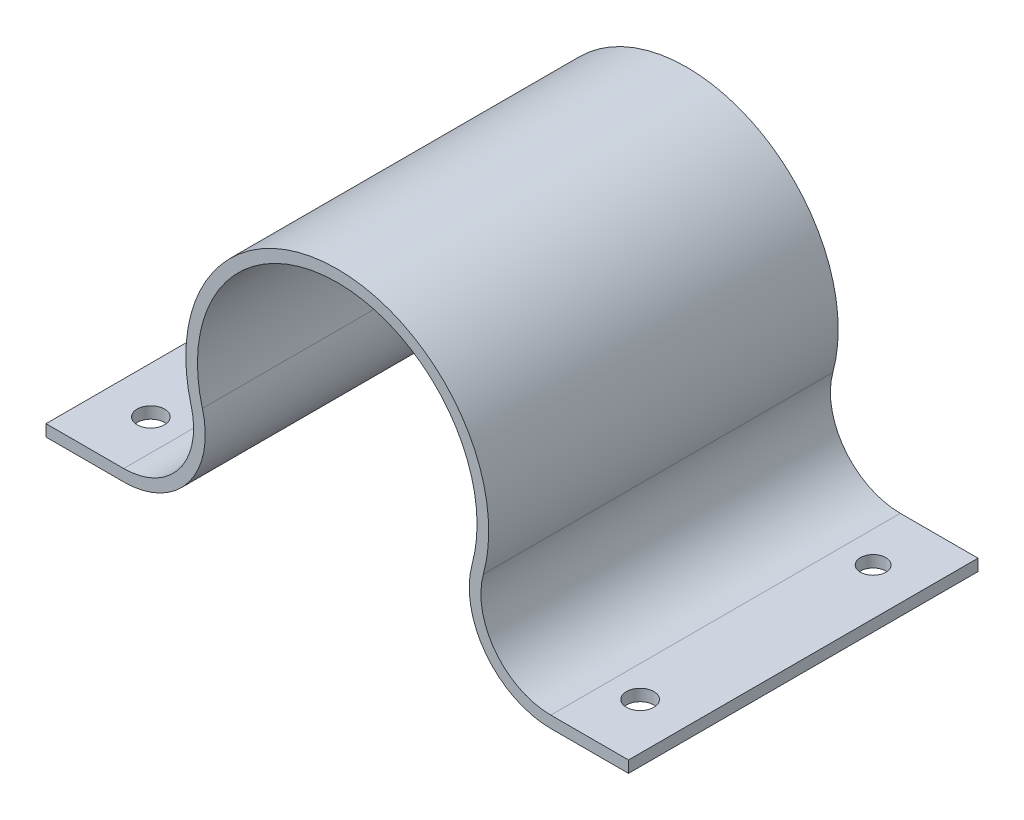
ISO-10303-21;
HEADER;
FILE_DESCRIPTION(('STEP AP214'),'2;1');
FILE_NAME('part.step','',(''),(''),'','','');
FILE_SCHEMA(('AUTOMOTIVE_DESIGN { 1 0 10303 214 1 1 1 1 }'));
ENDSEC;
DATA;
#1=APPLICATION_CONTEXT('core data for automotive mechanical design processes');
#2=APPLICATION_PROTOCOL_DEFINITION('international standard','automotive_design',2000,#1);
#3=PRODUCT_CONTEXT('',#1,'mechanical');
#4=PRODUCT('Part','Part','',(#3));
#5=PRODUCT_RELATED_PRODUCT_CATEGORY('part','',(#4));
#6=PRODUCT_DEFINITION_FORMATION('','',#4);
#7=PRODUCT_DEFINITION_CONTEXT('part definition',#1,'design');
#8=PRODUCT_DEFINITION('design','',#6,#7);
#9=PRODUCT_DEFINITION_SHAPE('','',#8);
#10=(LENGTH_UNIT() NAMED_UNIT(*) SI_UNIT(.MILLI.,.METRE.));
#11=(NAMED_UNIT(*) PLANE_ANGLE_UNIT() SI_UNIT($,.RADIAN.));
#12=(NAMED_UNIT(*) SI_UNIT($,.STERADIAN.) SOLID_ANGLE_UNIT());
#13=UNCERTAINTY_MEASURE_WITH_UNIT(LENGTH_MEASURE(1.E-05),#10,'distance_accuracy_value','');
#14=(GEOMETRIC_REPRESENTATION_CONTEXT(3) GLOBAL_UNCERTAINTY_ASSIGNED_CONTEXT((#13)) GLOBAL_UNIT_ASSIGNED_CONTEXT((#10,
#11,#12)) REPRESENTATION_CONTEXT('',''));
#15=CARTESIAN_POINT('',(0.,0.,0.));
#16=DIRECTION('',(0.,0.,1.));
#17=DIRECTION('',(1.,0.,0.));
#18=AXIS2_PLACEMENT_3D('',#15,#16,#17);
#19=CARTESIAN_POINT('',(-25.,-12.,30.));
#20=DIRECTION('',(0.,1.,0.));
#21=DIRECTION('',(0.,0.,1.));
#22=AXIS2_PLACEMENT_3D('',#19,#20,#21);
#23=PLANE('',#22);
#24=CARTESIAN_POINT('',(-21.,-12.,5.));
#25=DIRECTION('',(0.,1.,0.));
#26=DIRECTION('',(0.,0.,1.));
#27=AXIS2_PLACEMENT_3D('',#24,#25,#26);
#28=CIRCLE('',#27,1.08948365884662);
#29=CARTESIAN_POINT('',(-21.,-12.,6.08948365884662));
#30=VERTEX_POINT('',#29);
#31=EDGE_CURVE('E261',#30,#30,#28,.F.);
#32=ORIENTED_EDGE('',*,*,#31,.F.);
#33=EDGE_LOOP('',(#32));
#34=FACE_BOUND('',#33,.T.);
#35=DIRECTION('',(1.,0.,0.));
#36=VECTOR('',#35,1.);
#37=CARTESIAN_POINT('',(-25.,-12.,0.));
#38=LINE('',#37,#36);
#39=CARTESIAN_POINT('',(-25.,-12.,0.));
#40=VERTEX_POINT('',#39);
#41=CARTESIAN_POINT('',(-18.3303027798234,-12.,0.));
#42=VERTEX_POINT('',#41);
#43=EDGE_CURVE('E157',#40,#42,#38,.T.);
#44=ORIENTED_EDGE('',*,*,#43,.T.);
#45=DIRECTION('',(0.,0.,-1.));
#46=VECTOR('',#45,1.);
#47=CARTESIAN_POINT('',(-18.3303027798234,-12.,30.));
#48=LINE('',#47,#46);
#49=CARTESIAN_POINT('',(-18.3303027798234,-12.,30.));
#50=VERTEX_POINT('',#49);
#51=EDGE_CURVE('E42',#50,#42,#48,.T.);
#52=ORIENTED_EDGE('',*,*,#51,.F.);
#53=DIRECTION('',(1.,0.,0.));
#54=VECTOR('',#53,1.);
#55=CARTESIAN_POINT('',(-25.,-12.,30.));
#56=LINE('',#55,#54);
#57=CARTESIAN_POINT('',(-25.,-12.,30.));
#58=VERTEX_POINT('',#57);
#59=EDGE_CURVE('E105',#58,#50,#56,.T.);
#60=ORIENTED_EDGE('',*,*,#59,.F.);
#61=DIRECTION('',(0.,0.,-1.));
#62=VECTOR('',#61,1.);
#63=CARTESIAN_POINT('',(-25.,-12.,30.));
#64=LINE('',#63,#62);
#65=EDGE_CURVE('E11',#58,#40,#64,.T.);
#66=ORIENTED_EDGE('',*,*,#65,.T.);
#67=EDGE_LOOP('',(#44,#52,#60,#66));
#68=FACE_BOUND('',#67,.T.);
#69=CARTESIAN_POINT('',(-21.,-12.,25.));
#70=DIRECTION('',(0.,1.,0.));
#71=DIRECTION('',(0.,0.,1.));
#72=AXIS2_PLACEMENT_3D('',#69,#70,#71);
#73=CIRCLE('',#72,1.17399486576721);
#74=CARTESIAN_POINT('',(-21.,-12.,26.1739948657672));
#75=VERTEX_POINT('',#74);
#76=EDGE_CURVE('E253',#75,#75,#73,.F.);
#77=ORIENTED_EDGE('',*,*,#76,.F.);
#78=EDGE_LOOP('',(#77));
#79=FACE_BOUND('',#78,.T.);
#80=ADVANCED_FACE('F33',(#34,#68,#79),#23,.F.);
#81=CARTESIAN_POINT('',(-25.,-11.,30.));
#82=DIRECTION('',(0.,-1.,0.));
#83=DIRECTION('',(0.,0.,-1.));
#84=AXIS2_PLACEMENT_3D('',#81,#82,#83);
#85=PLANE('',#84);
#86=CARTESIAN_POINT('',(-21.,-11.,5.));
#87=DIRECTION('',(0.,-1.,0.));
#88=DIRECTION('',(1.,0.,0.));
#89=AXIS2_PLACEMENT_3D('',#86,#87,#88);
#90=CIRCLE('',#89,1.08948365884662);
#91=CARTESIAN_POINT('',(-19.9105163411534,-11.,5.));
#92=VERTEX_POINT('',#91);
#93=EDGE_CURVE('E256',#92,#92,#90,.T.);
#94=ORIENTED_EDGE('',*,*,#93,.T.);
#95=EDGE_LOOP('',(#94));
#96=FACE_BOUND('',#95,.T.);
#97=DIRECTION('',(-1.,0.,0.));
#98=VECTOR('',#97,1.);
#99=CARTESIAN_POINT('',(-25.,-11.,0.));
#100=LINE('',#99,#98);
#101=CARTESIAN_POINT('',(-18.3303027798234,-11.,0.));
#102=VERTEX_POINT('',#101);
#103=CARTESIAN_POINT('',(-25.,-11.,0.));
#104=VERTEX_POINT('',#103);
#105=EDGE_CURVE('E97',#102,#104,#100,.T.);
#106=ORIENTED_EDGE('',*,*,#105,.T.);
#107=DIRECTION('',(0.,0.,-1.));
#108=VECTOR('',#107,1.);
#109=CARTESIAN_POINT('',(-25.,-11.,30.));
#110=LINE('',#109,#108);
#111=CARTESIAN_POINT('',(-25.,-11.,30.));
#112=VERTEX_POINT('',#111);
#113=EDGE_CURVE('E150',#112,#104,#110,.T.);
#114=ORIENTED_EDGE('',*,*,#113,.F.);
#115=DIRECTION('',(-1.,0.,0.));
#116=VECTOR('',#115,1.);
#117=CARTESIAN_POINT('',(-25.,-11.,30.));
#118=LINE('',#117,#116);
#119=CARTESIAN_POINT('',(-18.3303027798234,-11.,30.));
#120=VERTEX_POINT('',#119);
#121=EDGE_CURVE('E50',#120,#112,#118,.T.);
#122=ORIENTED_EDGE('',*,*,#121,.F.);
#123=DIRECTION('',(0.,0.,-1.));
#124=VECTOR('',#123,1.);
#125=CARTESIAN_POINT('',(-18.3303027798234,-11.,30.));
#126=LINE('',#125,#124);
#127=EDGE_CURVE('E146',#120,#102,#126,.T.);
#128=ORIENTED_EDGE('',*,*,#127,.T.);
#129=EDGE_LOOP('',(#106,#114,#122,#128));
#130=FACE_BOUND('',#129,.T.);
#131=CARTESIAN_POINT('',(-21.,-11.,25.));
#132=DIRECTION('',(0.,-1.,0.));
#133=DIRECTION('',(1.,0.,0.));
#134=AXIS2_PLACEMENT_3D('',#131,#132,#133);
#135=CIRCLE('',#134,1.17399486576721);
#136=CARTESIAN_POINT('',(-19.8260051342328,-11.,25.));
#137=VERTEX_POINT('',#136);
#138=EDGE_CURVE('E251',#137,#137,#135,.T.);
#139=ORIENTED_EDGE('',*,*,#138,.T.);
#140=EDGE_LOOP('',(#139));
#141=FACE_BOUND('',#140,.T.);
#142=ADVANCED_FACE('F244',(#96,#130,#141),#85,.F.);
#143=CARTESIAN_POINT('',(-25.,-12.,30.));
#144=DIRECTION('',(1.,0.,0.));
#145=DIRECTION('',(0.,0.,-1.));
#146=AXIS2_PLACEMENT_3D('',#143,#144,#145);
#147=PLANE('',#146);
#148=DIRECTION('',(0.,-1.,0.));
#149=VECTOR('',#148,1.);
#150=CARTESIAN_POINT('',(-25.,-12.,0.));
#151=LINE('',#150,#149);
#152=EDGE_CURVE('E154',#104,#40,#151,.T.);
#153=ORIENTED_EDGE('',*,*,#152,.T.);
#154=ORIENTED_EDGE('',*,*,#65,.F.);
#155=DIRECTION('',(0.,-1.,0.));
#156=VECTOR('',#155,1.);
#157=CARTESIAN_POINT('',(-25.,-12.,30.));
#158=LINE('',#157,#156);
#159=EDGE_CURVE('E177',#112,#58,#158,.T.);
#160=ORIENTED_EDGE('',*,*,#159,.F.);
#161=ORIENTED_EDGE('',*,*,#113,.T.);
#162=EDGE_LOOP('',(#153,#154,#160,#161));
#163=FACE_BOUND('',#162,.T.);
#164=ADVANCED_FACE('F35',(#163),#147,.F.);
#165=CARTESIAN_POINT('',(-18.3303027798234,-5.,30.));
#166=DIRECTION('',(0.,0.,-1.));
#167=DIRECTION('',(-1.,0.,0.));
#168=AXIS2_PLACEMENT_3D('',#165,#166,#167);
#169=CYLINDRICAL_SURFACE('',#168,7.);
#170=CARTESIAN_POINT('',(-18.3303027798234,-5.,0.));
#171=DIRECTION('',(0.,0.,1.));
#172=DIRECTION('',(1.,0.,0.));
#173=AXIS2_PLACEMENT_3D('',#170,#171,#172);
#174=CIRCLE('',#173,7.);
#175=CARTESIAN_POINT('',(-11.5770333346253,-3.1578947368421,0.));
#176=VERTEX_POINT('',#175);
#177=EDGE_CURVE('E160',#42,#176,#174,.T.);
#178=ORIENTED_EDGE('',*,*,#177,.T.);
#179=DIRECTION('',(0.,0.,-1.));
#180=VECTOR('',#179,1.);
#181=CARTESIAN_POINT('',(-11.5770333346253,-3.1578947368421,30.));
#182=LINE('',#181,#180);
#183=CARTESIAN_POINT('',(-11.5770333346253,-3.1578947368421,30.));
#184=VERTEX_POINT('',#183);
#185=EDGE_CURVE('E196',#184,#176,#182,.T.);
#186=ORIENTED_EDGE('',*,*,#185,.F.);
#187=CARTESIAN_POINT('',(-18.3303027798234,-5.,30.));
#188=DIRECTION('',(0.,0.,1.));
#189=DIRECTION('',(1.,0.,0.));
#190=AXIS2_PLACEMENT_3D('',#187,#188,#189);
#191=CIRCLE('',#190,7.);
#192=EDGE_CURVE('E204',#50,#184,#191,.T.);
#193=ORIENTED_EDGE('',*,*,#192,.F.);
#194=ORIENTED_EDGE('',*,*,#51,.T.);
#195=EDGE_LOOP('',(#178,#186,#193,#194));
#196=FACE_BOUND('',#195,.T.);
#197=ADVANCED_FACE('F202',(#196),#169,.T.);
#198=CARTESIAN_POINT('',(0.,0.,30.));
#199=DIRECTION('',(0.,0.,-1.));
#200=DIRECTION('',(-1.,0.,0.));
#201=AXIS2_PLACEMENT_3D('',#198,#199,#200);
#202=CYLINDRICAL_SURFACE('',#201,12.);
#203=CARTESIAN_POINT('',(0.,0.,0.));
#204=DIRECTION('',(0.,0.,-1.));
#205=DIRECTION('',(1.,0.,0.));
#206=AXIS2_PLACEMENT_3D('',#203,#204,#205);
#207=CIRCLE('',#206,12.);
#208=CARTESIAN_POINT('',(11.5770333346253,-3.15789473684211,0.));
#209=VERTEX_POINT('',#208);
#210=EDGE_CURVE('E162',#176,#209,#207,.T.);
#211=ORIENTED_EDGE('',*,*,#210,.T.);
#212=DIRECTION('',(0.,0.,-1.));
#213=VECTOR('',#212,1.);
#214=CARTESIAN_POINT('',(11.5770333346253,-3.15789473684211,30.));
#215=LINE('',#214,#213);
#216=CARTESIAN_POINT('',(11.5770333346253,-3.15789473684211,30.));
#217=VERTEX_POINT('',#216);
#218=EDGE_CURVE('E193',#217,#209,#215,.T.);
#219=ORIENTED_EDGE('',*,*,#218,.F.);
#220=CARTESIAN_POINT('',(0.,0.,30.));
#221=DIRECTION('',(0.,0.,-1.));
#222=DIRECTION('',(1.,0.,0.));
#223=AXIS2_PLACEMENT_3D('',#220,#221,#222);
#224=CIRCLE('',#223,12.);
#225=EDGE_CURVE('E222',#184,#217,#224,.T.);
#226=ORIENTED_EDGE('',*,*,#225,.F.);
#227=ORIENTED_EDGE('',*,*,#185,.T.);
#228=EDGE_LOOP('',(#211,#219,#226,#227));
#229=FACE_BOUND('',#228,.T.);
#230=ADVANCED_FACE('F213',(#229),#202,.F.);
#231=CARTESIAN_POINT('',(18.3303027798234,-5.,30.));
#232=DIRECTION('',(0.,0.,-1.));
#233=DIRECTION('',(-1.,0.,0.));
#234=AXIS2_PLACEMENT_3D('',#231,#232,#233);
#235=CYLINDRICAL_SURFACE('',#234,7.);
#236=CARTESIAN_POINT('',(18.3303027798234,-5.,0.));
#237=DIRECTION('',(0.,0.,1.));
#238=DIRECTION('',(-1.,0.,0.));
#239=AXIS2_PLACEMENT_3D('',#236,#237,#238);
#240=CIRCLE('',#239,7.);
#241=CARTESIAN_POINT('',(18.3303027798234,-12.,0.));
#242=VERTEX_POINT('',#241);
#243=EDGE_CURVE('E164',#209,#242,#240,.T.);
#244=ORIENTED_EDGE('',*,*,#243,.T.);
#245=DIRECTION('',(0.,0.,-1.));
#246=VECTOR('',#245,1.);
#247=CARTESIAN_POINT('',(18.3303027798234,-12.,30.));
#248=LINE('',#247,#246);
#249=CARTESIAN_POINT('',(18.3303027798234,-12.,30.));
#250=VERTEX_POINT('',#249);
#251=EDGE_CURVE('E190',#250,#242,#248,.T.);
#252=ORIENTED_EDGE('',*,*,#251,.F.);
#253=CARTESIAN_POINT('',(18.3303027798234,-5.,30.));
#254=DIRECTION('',(0.,0.,1.));
#255=DIRECTION('',(-1.,0.,0.));
#256=AXIS2_PLACEMENT_3D('',#253,#254,#255);
#257=CIRCLE('',#256,7.);
#258=EDGE_CURVE('E219',#217,#250,#257,.T.);
#259=ORIENTED_EDGE('',*,*,#258,.F.);
#260=ORIENTED_EDGE('',*,*,#218,.T.);
#261=EDGE_LOOP('',(#244,#252,#259,#260));
#262=FACE_BOUND('',#261,.T.);
#263=ADVANCED_FACE('F217',(#262),#235,.T.);
#264=CARTESIAN_POINT('',(18.3303027798234,-12.,30.));
#265=DIRECTION('',(0.,1.,0.));
#266=DIRECTION('',(-1.,0.,0.));
#267=AXIS2_PLACEMENT_3D('',#264,#265,#266);
#268=PLANE('',#267);
#269=CARTESIAN_POINT('',(21.,-12.,25.));
#270=DIRECTION('',(0.,1.,0.));
#271=DIRECTION('',(-1.,0.,0.));
#272=AXIS2_PLACEMENT_3D('',#269,#270,#271);
#273=CIRCLE('',#272,1.17399486576721);
#274=CARTESIAN_POINT('',(19.8260051342328,-12.,25.));
#275=VERTEX_POINT('',#274);
#276=EDGE_CURVE('E267',#275,#275,#273,.T.);
#277=ORIENTED_EDGE('',*,*,#276,.T.);
#278=EDGE_LOOP('',(#277));
#279=FACE_BOUND('',#278,.T.);
#280=CARTESIAN_POINT('',(21.,-12.,5.));
#281=DIRECTION('',(0.,1.,0.));
#282=DIRECTION('',(-1.,0.,0.));
#283=AXIS2_PLACEMENT_3D('',#280,#281,#282);
#284=CIRCLE('',#283,1.08948365884662);
#285=CARTESIAN_POINT('',(19.9105163411534,-12.,5.));
#286=VERTEX_POINT('',#285);
#287=EDGE_CURVE('E158',#286,#286,#284,.T.);
#288=ORIENTED_EDGE('',*,*,#287,.T.);
#289=EDGE_LOOP('',(#288));
#290=FACE_BOUND('',#289,.T.);
#291=DIRECTION('',(1.,0.,0.));
#292=VECTOR('',#291,1.);
#293=CARTESIAN_POINT('',(18.3303027798234,-12.,0.));
#294=LINE('',#293,#292);
#295=CARTESIAN_POINT('',(25.,-12.,0.));
#296=VERTEX_POINT('',#295);
#297=EDGE_CURVE('E166',#242,#296,#294,.T.);
#298=ORIENTED_EDGE('',*,*,#297,.T.);
#299=DIRECTION('',(0.,0.,-1.));
#300=VECTOR('',#299,1.);
#301=CARTESIAN_POINT('',(25.,-12.,30.));
#302=LINE('',#301,#300);
#303=CARTESIAN_POINT('',(25.,-12.,30.));
#304=VERTEX_POINT('',#303);
#305=EDGE_CURVE('E187',#304,#296,#302,.T.);
#306=ORIENTED_EDGE('',*,*,#305,.F.);
#307=DIRECTION('',(1.,0.,0.));
#308=VECTOR('',#307,1.);
#309=CARTESIAN_POINT('',(18.3303027798234,-12.,30.));
#310=LINE('',#309,#308);
#311=EDGE_CURVE('E221',#250,#304,#310,.T.);
#312=ORIENTED_EDGE('',*,*,#311,.F.);
#313=ORIENTED_EDGE('',*,*,#251,.T.);
#314=EDGE_LOOP('',(#298,#306,#312,#313));
#315=FACE_BOUND('',#314,.T.);
#316=ADVANCED_FACE('F278',(#279,#290,#315),#268,.F.);
#317=CARTESIAN_POINT('',(25.,-12.,30.));
#318=DIRECTION('',(-1.,0.,0.));
#319=DIRECTION('',(0.,0.,1.));
#320=AXIS2_PLACEMENT_3D('',#317,#318,#319);
#321=PLANE('',#320);
#322=DIRECTION('',(0.,1.,0.));
#323=VECTOR('',#322,1.);
#324=CARTESIAN_POINT('',(25.,-12.,0.));
#325=LINE('',#324,#323);
#326=CARTESIAN_POINT('',(25.,-11.,0.));
#327=VERTEX_POINT('',#326);
#328=EDGE_CURVE('E168',#296,#327,#325,.T.);
#329=ORIENTED_EDGE('',*,*,#328,.T.);
#330=DIRECTION('',(0.,0.,-1.));
#331=VECTOR('',#330,1.);
#332=CARTESIAN_POINT('',(25.,-11.,30.));
#333=LINE('',#332,#331);
#334=CARTESIAN_POINT('',(25.,-11.,30.));
#335=VERTEX_POINT('',#334);
#336=EDGE_CURVE('E184',#335,#327,#333,.T.);
#337=ORIENTED_EDGE('',*,*,#336,.F.);
#338=DIRECTION('',(0.,1.,0.));
#339=VECTOR('',#338,1.);
#340=CARTESIAN_POINT('',(25.,-12.,30.));
#341=LINE('',#340,#339);
#342=EDGE_CURVE('E224',#304,#335,#341,.T.);
#343=ORIENTED_EDGE('',*,*,#342,.F.);
#344=ORIENTED_EDGE('',*,*,#305,.T.);
#345=EDGE_LOOP('',(#329,#337,#343,#344));
#346=FACE_BOUND('',#345,.T.);
#347=ADVANCED_FACE('F309',(#346),#321,.F.);
#348=CARTESIAN_POINT('',(18.3303027798234,-11.,30.));
#349=DIRECTION('',(0.,-1.,0.));
#350=DIRECTION('',(1.,0.,0.));
#351=AXIS2_PLACEMENT_3D('',#348,#349,#350);
#352=PLANE('',#351);
#353=CARTESIAN_POINT('',(21.,-11.,25.));
#354=DIRECTION('',(0.,1.,0.));
#355=DIRECTION('',(-1.,0.,0.));
#356=AXIS2_PLACEMENT_3D('',#353,#354,#355);
#357=CIRCLE('',#356,1.17399486576721);
#358=CARTESIAN_POINT('',(19.8260051342328,-11.,25.));
#359=VERTEX_POINT('',#358);
#360=EDGE_CURVE('E264',#359,#359,#357,.T.);
#361=ORIENTED_EDGE('',*,*,#360,.F.);
#362=EDGE_LOOP('',(#361));
#363=FACE_BOUND('',#362,.T.);
#364=CARTESIAN_POINT('',(21.,-11.,5.));
#365=DIRECTION('',(0.,1.,0.));
#366=DIRECTION('',(-1.,0.,0.));
#367=AXIS2_PLACEMENT_3D('',#364,#365,#366);
#368=CIRCLE('',#367,1.08948365884662);
#369=CARTESIAN_POINT('',(19.9105163411534,-11.,5.));
#370=VERTEX_POINT('',#369);
#371=EDGE_CURVE('E270',#370,#370,#368,.T.);
#372=ORIENTED_EDGE('',*,*,#371,.F.);
#373=EDGE_LOOP('',(#372));
#374=FACE_BOUND('',#373,.T.);
#375=DIRECTION('',(-1.,0.,0.));
#376=VECTOR('',#375,1.);
#377=CARTESIAN_POINT('',(18.3303027798234,-11.,0.));
#378=LINE('',#377,#376);
#379=CARTESIAN_POINT('',(18.3303027798234,-11.,0.));
#380=VERTEX_POINT('',#379);
#381=EDGE_CURVE('E170',#327,#380,#378,.T.);
#382=ORIENTED_EDGE('',*,*,#381,.T.);
#383=DIRECTION('',(0.,0.,-1.));
#384=VECTOR('',#383,1.);
#385=CARTESIAN_POINT('',(18.3303027798234,-11.,30.));
#386=LINE('',#385,#384);
#387=CARTESIAN_POINT('',(18.3303027798234,-11.,30.));
#388=VERTEX_POINT('',#387);
#389=EDGE_CURVE('E181',#388,#380,#386,.T.);
#390=ORIENTED_EDGE('',*,*,#389,.F.);
#391=DIRECTION('',(-1.,0.,0.));
#392=VECTOR('',#391,1.);
#393=CARTESIAN_POINT('',(18.3303027798234,-11.,30.));
#394=LINE('',#393,#392);
#395=EDGE_CURVE('E230',#335,#388,#394,.T.);
#396=ORIENTED_EDGE('',*,*,#395,.F.);
#397=ORIENTED_EDGE('',*,*,#336,.T.);
#398=EDGE_LOOP('',(#382,#390,#396,#397));
#399=FACE_BOUND('',#398,.T.);
#400=ADVANCED_FACE('F236',(#363,#374,#399),#352,.F.);
#401=CARTESIAN_POINT('',(18.3303027798234,-5.,30.));
#402=DIRECTION('',(0.,0.,-1.));
#403=DIRECTION('',(-1.,0.,0.));
#404=AXIS2_PLACEMENT_3D('',#401,#402,#403);
#405=CYLINDRICAL_SURFACE('',#404,6.);
#406=CARTESIAN_POINT('',(18.3303027798234,-5.,0.));
#407=DIRECTION('',(0.,0.,-1.));
#408=DIRECTION('',(-1.,0.,0.));
#409=AXIS2_PLACEMENT_3D('',#406,#407,#408);
#410=CIRCLE('',#409,6.);
#411=CARTESIAN_POINT('',(12.5417861125107,-3.42105263157895,0.));
#412=VERTEX_POINT('',#411);
#413=EDGE_CURVE('E172',#380,#412,#410,.T.);
#414=ORIENTED_EDGE('',*,*,#413,.T.);
#415=DIRECTION('',(0.,0.,-1.));
#416=VECTOR('',#415,1.);
#417=CARTESIAN_POINT('',(12.5417861125107,-3.42105263157895,30.));
#418=LINE('',#417,#416);
#419=CARTESIAN_POINT('',(12.5417861125107,-3.42105263157895,30.));
#420=VERTEX_POINT('',#419);
#421=EDGE_CURVE('E145',#420,#412,#418,.T.);
#422=ORIENTED_EDGE('',*,*,#421,.F.);
#423=CARTESIAN_POINT('',(18.3303027798234,-5.,30.));
#424=DIRECTION('',(0.,0.,-1.));
#425=DIRECTION('',(-1.,0.,0.));
#426=AXIS2_PLACEMENT_3D('',#423,#424,#425);
#427=CIRCLE('',#426,6.);
#428=EDGE_CURVE('E136',#388,#420,#427,.T.);
#429=ORIENTED_EDGE('',*,*,#428,.F.);
#430=ORIENTED_EDGE('',*,*,#389,.T.);
#431=EDGE_LOOP('',(#414,#422,#429,#430));
#432=FACE_BOUND('',#431,.T.);
#433=ADVANCED_FACE('F240',(#432),#405,.F.);
#434=CARTESIAN_POINT('',(0.,0.,30.));
#435=DIRECTION('',(0.,0.,-1.));
#436=DIRECTION('',(-1.,0.,0.));
#437=AXIS2_PLACEMENT_3D('',#434,#435,#436);
#438=CYLINDRICAL_SURFACE('',#437,13.);
#439=CARTESIAN_POINT('',(0.,0.,0.));
#440=DIRECTION('',(0.,0.,1.));
#441=DIRECTION('',(1.,0.,0.));
#442=AXIS2_PLACEMENT_3D('',#439,#440,#441);
#443=CIRCLE('',#442,13.);
#444=CARTESIAN_POINT('',(-12.5417861125107,-3.42105263157894,0.));
#445=VERTEX_POINT('',#444);
#446=EDGE_CURVE('E144',#412,#445,#443,.T.);
#447=ORIENTED_EDGE('',*,*,#446,.T.);
#448=DIRECTION('',(0.,0.,-1.));
#449=VECTOR('',#448,1.);
#450=CARTESIAN_POINT('',(-12.5417861125107,-3.42105263157894,30.));
#451=LINE('',#450,#449);
#452=CARTESIAN_POINT('',(-12.5417861125107,-3.42105263157894,30.));
#453=VERTEX_POINT('',#452);
#454=EDGE_CURVE('E141',#453,#445,#451,.T.);
#455=ORIENTED_EDGE('',*,*,#454,.F.);
#456=CARTESIAN_POINT('',(0.,0.,30.));
#457=DIRECTION('',(0.,0.,1.));
#458=DIRECTION('',(1.,0.,0.));
#459=AXIS2_PLACEMENT_3D('',#456,#457,#458);
#460=CIRCLE('',#459,13.);
#461=EDGE_CURVE('E130',#420,#453,#460,.T.);
#462=ORIENTED_EDGE('',*,*,#461,.F.);
#463=ORIENTED_EDGE('',*,*,#421,.T.);
#464=EDGE_LOOP('',(#447,#455,#462,#463));
#465=FACE_BOUND('',#464,.T.);
#466=ADVANCED_FACE('F142',(#465),#438,.T.);
#467=CARTESIAN_POINT('',(-18.3303027798234,-5.,30.));
#468=DIRECTION('',(0.,0.,-1.));
#469=DIRECTION('',(-1.,0.,0.));
#470=AXIS2_PLACEMENT_3D('',#467,#468,#469);
#471=CYLINDRICAL_SURFACE('',#470,6.);
#472=CARTESIAN_POINT('',(-18.3303027798234,-5.,0.));
#473=DIRECTION('',(0.,0.,-1.));
#474=DIRECTION('',(1.,0.,0.));
#475=AXIS2_PLACEMENT_3D('',#472,#473,#474);
#476=CIRCLE('',#475,6.);
#477=EDGE_CURVE('E91',#445,#102,#476,.T.);
#478=ORIENTED_EDGE('',*,*,#477,.T.);
#479=ORIENTED_EDGE('',*,*,#127,.F.);
#480=CARTESIAN_POINT('',(-18.3303027798234,-5.,30.));
#481=DIRECTION('',(0.,0.,-1.));
#482=DIRECTION('',(1.,0.,0.));
#483=AXIS2_PLACEMENT_3D('',#480,#481,#482);
#484=CIRCLE('',#483,6.);
#485=EDGE_CURVE('E134',#453,#120,#484,.T.);
#486=ORIENTED_EDGE('',*,*,#485,.F.);
#487=ORIENTED_EDGE('',*,*,#454,.T.);
#488=EDGE_LOOP('',(#478,#479,#486,#487));
#489=FACE_BOUND('',#488,.T.);
#490=ADVANCED_FACE('F148',(#489),#471,.F.);
#491=CARTESIAN_POINT('',(-18.3303027798234,-5.,30.));
#492=DIRECTION('',(0.,0.,1.));
#493=DIRECTION('',(1.,0.,0.));
#494=AXIS2_PLACEMENT_3D('',#491,#492,#493);
#495=PLANE('',#494);
#496=ORIENTED_EDGE('',*,*,#159,.T.);
#497=ORIENTED_EDGE('',*,*,#59,.T.);
#498=ORIENTED_EDGE('',*,*,#192,.T.);
#499=ORIENTED_EDGE('',*,*,#225,.T.);
#500=ORIENTED_EDGE('',*,*,#258,.T.);
#501=ORIENTED_EDGE('',*,*,#311,.T.);
#502=ORIENTED_EDGE('',*,*,#342,.T.);
#503=ORIENTED_EDGE('',*,*,#395,.T.);
#504=ORIENTED_EDGE('',*,*,#428,.T.);
#505=ORIENTED_EDGE('',*,*,#461,.T.);
#506=ORIENTED_EDGE('',*,*,#485,.T.);
#507=ORIENTED_EDGE('',*,*,#121,.T.);
#508=EDGE_LOOP('',(#496,#497,#498,#499,#500,#501,#502,#503,#504,#505,#506,#507));
#509=FACE_BOUND('',#508,.T.);
#510=ADVANCED_FACE('F132',(#509),#495,.T.);
#511=CARTESIAN_POINT('',(-18.3303027798234,-5.,0.));
#512=DIRECTION('',(0.,0.,1.));
#513=DIRECTION('',(1.,0.,0.));
#514=AXIS2_PLACEMENT_3D('',#511,#512,#513);
#515=PLANE('',#514);
#516=ORIENTED_EDGE('',*,*,#152,.F.);
#517=ORIENTED_EDGE('',*,*,#105,.F.);
#518=ORIENTED_EDGE('',*,*,#477,.F.);
#519=ORIENTED_EDGE('',*,*,#446,.F.);
#520=ORIENTED_EDGE('',*,*,#413,.F.);
#521=ORIENTED_EDGE('',*,*,#381,.F.);
#522=ORIENTED_EDGE('',*,*,#328,.F.);
#523=ORIENTED_EDGE('',*,*,#297,.F.);
#524=ORIENTED_EDGE('',*,*,#243,.F.);
#525=ORIENTED_EDGE('',*,*,#210,.F.);
#526=ORIENTED_EDGE('',*,*,#177,.F.);
#527=ORIENTED_EDGE('',*,*,#43,.F.);
#528=EDGE_LOOP('',(#516,#517,#518,#519,#520,#521,#522,#523,#524,#525,#526,#527));
#529=FACE_BOUND('',#528,.T.);
#530=ADVANCED_FACE('F208',(#529),#515,.F.);
#531=CARTESIAN_POINT('',(21.,-26.,5.));
#532=DIRECTION('',(0.,1.,0.));
#533=DIRECTION('',(-1.,0.,0.));
#534=AXIS2_PLACEMENT_3D('',#531,#532,#533);
#535=CYLINDRICAL_SURFACE('',#534,1.08948365884662);
#536=ORIENTED_EDGE('',*,*,#371,.T.);
#537=EDGE_LOOP('',(#536));
#538=FACE_BOUND('',#537,.T.);
#539=ORIENTED_EDGE('',*,*,#287,.F.);
#540=EDGE_LOOP('',(#539));
#541=FACE_BOUND('',#540,.T.);
#542=ADVANCED_FACE('F281',(#538,#541),#535,.F.);
#543=CARTESIAN_POINT('',(21.,-26.,25.));
#544=DIRECTION('',(0.,1.,0.));
#545=DIRECTION('',(-1.,0.,0.));
#546=AXIS2_PLACEMENT_3D('',#543,#544,#545);
#547=CYLINDRICAL_SURFACE('',#546,1.17399486576721);
#548=ORIENTED_EDGE('',*,*,#360,.T.);
#549=EDGE_LOOP('',(#548));
#550=FACE_BOUND('',#549,.T.);
#551=ORIENTED_EDGE('',*,*,#276,.F.);
#552=EDGE_LOOP('',(#551));
#553=FACE_BOUND('',#552,.T.);
#554=ADVANCED_FACE('F283',(#550,#553),#547,.F.);
#555=CARTESIAN_POINT('',(-21.,-26.,5.));
#556=DIRECTION('',(0.,1.,0.));
#557=DIRECTION('',(-1.,0.,0.));
#558=AXIS2_PLACEMENT_3D('',#555,#556,#557);
#559=CYLINDRICAL_SURFACE('',#558,1.08948365884662);
#560=ORIENTED_EDGE('',*,*,#93,.F.);
#561=EDGE_LOOP('',(#560));
#562=FACE_BOUND('',#561,.T.);
#563=ORIENTED_EDGE('',*,*,#31,.T.);
#564=EDGE_LOOP('',(#563));
#565=FACE_BOUND('',#564,.T.);
#566=ADVANCED_FACE('F290',(#562,#565),#559,.F.);
#567=CARTESIAN_POINT('',(-21.,-26.,25.));
#568=DIRECTION('',(0.,1.,0.));
#569=DIRECTION('',(-1.,0.,0.));
#570=AXIS2_PLACEMENT_3D('',#567,#568,#569);
#571=CYLINDRICAL_SURFACE('',#570,1.17399486576721);
#572=ORIENTED_EDGE('',*,*,#138,.F.);
#573=EDGE_LOOP('',(#572));
#574=FACE_BOUND('',#573,.T.);
#575=ORIENTED_EDGE('',*,*,#76,.T.);
#576=EDGE_LOOP('',(#575));
#577=FACE_BOUND('',#576,.T.);
#578=ADVANCED_FACE('F376',(#574,#577),#571,.F.);
#579=CLOSED_SHELL('',(#80,#142,#164,#197,#230,#263,#316,#347,#400,#433,#466,#490,#510,#530,#542,
#554,#566,#578));
#580=MANIFOLD_SOLID_BREP('B2',#579);
#581=ADVANCED_BREP_SHAPE_REPRESENTATION('',(#18,#580),#14);
#582=SHAPE_DEFINITION_REPRESENTATION(#9,#581);
ENDSEC;
END-ISO-10303-21;
